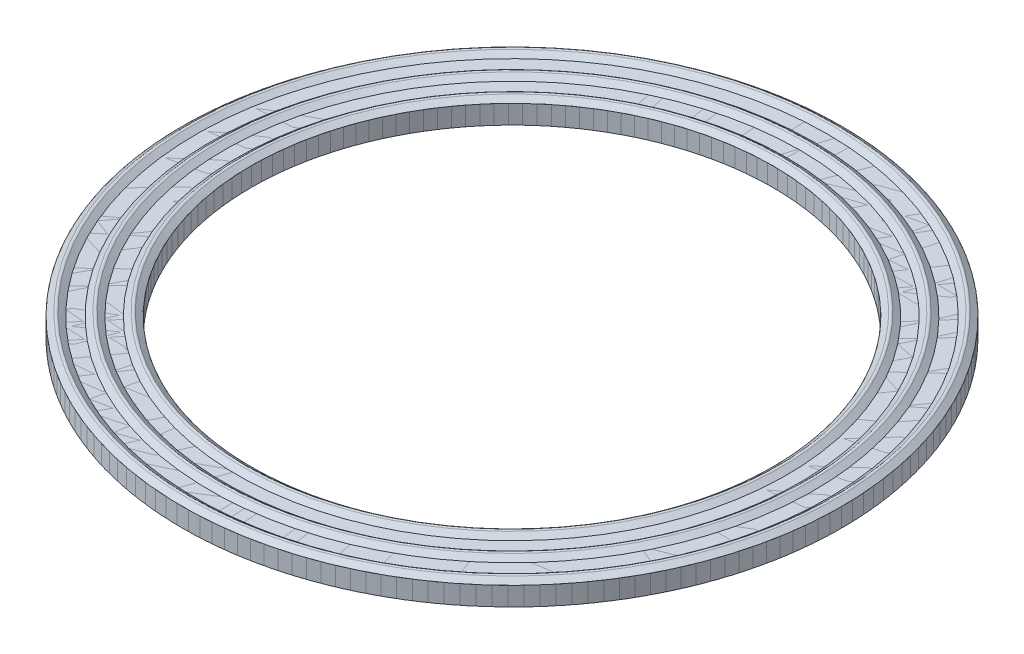
ISO-10303-21;
HEADER;
FILE_DESCRIPTION(('STEP AP214'),'2;1');
FILE_NAME('part.step','',(''),(''),'','','');
FILE_SCHEMA(('AUTOMOTIVE_DESIGN { 1 0 10303 214 1 1 1 1 }'));
ENDSEC;
DATA;
#1=APPLICATION_CONTEXT('core data for automotive mechanical design processes');
#2=APPLICATION_PROTOCOL_DEFINITION('international standard','automotive_design',2000,#1);
#3=PRODUCT_CONTEXT('',#1,'mechanical');
#4=PRODUCT('Part','Part','',(#3));
#5=PRODUCT_RELATED_PRODUCT_CATEGORY('part','',(#4));
#6=PRODUCT_DEFINITION_FORMATION('','',#4);
#7=PRODUCT_DEFINITION_CONTEXT('part definition',#1,'design');
#8=PRODUCT_DEFINITION('design','',#6,#7);
#9=PRODUCT_DEFINITION_SHAPE('','',#8);
#10=(LENGTH_UNIT() NAMED_UNIT(*) SI_UNIT(.MILLI.,.METRE.));
#11=(NAMED_UNIT(*) PLANE_ANGLE_UNIT() SI_UNIT($,.RADIAN.));
#12=(NAMED_UNIT(*) SI_UNIT($,.STERADIAN.) SOLID_ANGLE_UNIT());
#13=UNCERTAINTY_MEASURE_WITH_UNIT(LENGTH_MEASURE(1.E-05),#10,'distance_accuracy_value','');
#14=(GEOMETRIC_REPRESENTATION_CONTEXT(3) GLOBAL_UNCERTAINTY_ASSIGNED_CONTEXT((#13)) GLOBAL_UNIT_ASSIGNED_CONTEXT((#10,
#11,#12)) REPRESENTATION_CONTEXT('',''));
#15=CARTESIAN_POINT('',(0.,0.,0.));
#16=DIRECTION('',(0.,0.,1.));
#17=DIRECTION('',(1.,0.,0.));
#18=AXIS2_PLACEMENT_3D('',#15,#16,#17);
#19=CARTESIAN_POINT('',(0.,1.9558,0.));
#20=DIRECTION('',(0.,-1.,0.));
#21=DIRECTION('',(0.,0.,-1.));
#22=AXIS2_PLACEMENT_3D('',#19,#20,#21);
#23=CONICAL_SURFACE('',#22,34.32175,0.920002565653075);
#24=CARTESIAN_POINT('',(0.,2.39234857258727,0.));
#25=DIRECTION('',(0.,-1.,0.));
#26=DIRECTION('',(0.,0.,-1.));
#27=AXIS2_PLACEMENT_3D('',#24,#25,#26);
#28=CIRCLE('',#27,33.7484435549122);
#29=CARTESIAN_POINT('',(0.,2.39234857258727,-33.7484435549122));
#30=VERTEX_POINT('',#29);
#31=EDGE_CURVE('E11',#30,#30,#28,.T.);
#32=ORIENTED_EDGE('',*,*,#31,.T.);
#33=EDGE_LOOP('',(#32));
#34=FACE_BOUND('',#33,.T.);
#35=CARTESIAN_POINT('',(0.,1.9558,0.));
#36=DIRECTION('',(0.,-1.,0.));
#37=DIRECTION('',(0.,0.,-1.));
#38=AXIS2_PLACEMENT_3D('',#35,#36,#37);
#39=CIRCLE('',#38,34.32175);
#40=CARTESIAN_POINT('',(0.,1.9558,-34.32175));
#41=VERTEX_POINT('',#40);
#42=EDGE_CURVE('E110',#41,#41,#39,.T.);
#43=ORIENTED_EDGE('',*,*,#42,.F.);
#44=EDGE_LOOP('',(#43));
#45=FACE_BOUND('',#44,.T.);
#46=ADVANCED_FACE('F40',(#34,#45),#23,.T.);
#47=CARTESIAN_POINT('',(0.,2.19026536630032,0.));
#48=DIRECTION('',(0.,-1.,0.));
#49=DIRECTION('',(0.,0.,-1.));
#50=AXIS2_PLACEMENT_3D('',#47,#48,#49);
#51=TOROIDAL_SURFACE('',#50,33.5945657535996,0.254);
#52=CARTESIAN_POINT('',(0.,2.39234857258727,0.));
#53=DIRECTION('',(0.,-1.,0.));
#54=DIRECTION('',(0.,0.,-1.));
#55=AXIS2_PLACEMENT_3D('',#52,#53,#54);
#56=CIRCLE('',#55,33.4406879522871);
#57=CARTESIAN_POINT('',(0.,2.39234857258727,-33.4406879522871));
#58=VERTEX_POINT('',#57);
#59=EDGE_CURVE('E46',#58,#58,#56,.T.);
#60=ORIENTED_EDGE('',*,*,#59,.T.);
#61=EDGE_LOOP('',(#60));
#62=FACE_BOUND('',#61,.T.);
#63=ORIENTED_EDGE('',*,*,#31,.F.);
#64=EDGE_LOOP('',(#63));
#65=FACE_BOUND('',#64,.T.);
#66=ADVANCED_FACE('F118',(#62,#65),#51,.T.);
#67=CARTESIAN_POINT('',(0.,2.39234857258727,0.));
#68=DIRECTION('',(0.,1.,0.));
#69=DIRECTION('',(0.,0.,1.));
#70=AXIS2_PLACEMENT_3D('',#67,#68,#69);
#71=CONICAL_SURFACE('',#70,33.4406879522871,0.920002565653075);
#72=CARTESIAN_POINT('',(0.,1.9558,0.));
#73=DIRECTION('',(0.,-1.,0.));
#74=DIRECTION('',(0.,0.,-1.));
#75=AXIS2_PLACEMENT_3D('',#72,#73,#74);
#76=CIRCLE('',#75,32.8673815071992);
#77=CARTESIAN_POINT('',(0.,1.9558,-32.8673815071992));
#78=VERTEX_POINT('',#77);
#79=EDGE_CURVE('E50',#78,#78,#76,.T.);
#80=ORIENTED_EDGE('',*,*,#79,.T.);
#81=EDGE_LOOP('',(#80));
#82=FACE_BOUND('',#81,.T.);
#83=ORIENTED_EDGE('',*,*,#59,.F.);
#84=EDGE_LOOP('',(#83));
#85=FACE_BOUND('',#84,.T.);
#86=ADVANCED_FACE('F122',(#82,#85),#71,.F.);
#87=CARTESIAN_POINT('',(0.,1.9558,-31.4406180828677));
#88=DIRECTION('',(0.,1.,0.));
#89=DIRECTION('',(0.,0.,1.));
#90=AXIS2_PLACEMENT_3D('',#87,#88,#89);
#91=PLANE('',#90);
#92=CARTESIAN_POINT('',(0.,1.9558,0.));
#93=DIRECTION('',(0.,-1.,0.));
#94=DIRECTION('',(0.,0.,-1.));
#95=AXIS2_PLACEMENT_3D('',#92,#93,#94);
#96=CIRCLE('',#95,31.4406180828677);
#97=CARTESIAN_POINT('',(0.,1.9558,-31.4406180828677));
#98=VERTEX_POINT('',#97);
#99=EDGE_CURVE('E54',#98,#98,#96,.T.);
#100=ORIENTED_EDGE('',*,*,#99,.T.);
#101=EDGE_LOOP('',(#100));
#102=FACE_BOUND('',#101,.T.);
#103=ORIENTED_EDGE('',*,*,#79,.F.);
#104=EDGE_LOOP('',(#103));
#105=FACE_BOUND('',#104,.T.);
#106=ADVANCED_FACE('F126',(#102,#105),#91,.T.);
#107=CARTESIAN_POINT('',(0.,1.9558,0.));
#108=DIRECTION('',(0.,-1.,0.));
#109=DIRECTION('',(0.,0.,-1.));
#110=AXIS2_PLACEMENT_3D('',#107,#108,#109);
#111=CONICAL_SURFACE('',#110,31.4406180828677,0.920002565653078);
#112=CARTESIAN_POINT('',(0.,2.39234857258727,0.));
#113=DIRECTION('',(0.,-1.,0.));
#114=DIRECTION('',(0.,0.,-1.));
#115=AXIS2_PLACEMENT_3D('',#112,#113,#114);
#116=CIRCLE('',#115,30.8673116377798);
#117=CARTESIAN_POINT('',(0.,2.39234857258727,-30.8673116377798));
#118=VERTEX_POINT('',#117);
#119=EDGE_CURVE('E59',#118,#118,#116,.T.);
#120=ORIENTED_EDGE('',*,*,#119,.T.);
#121=EDGE_LOOP('',(#120));
#122=FACE_BOUND('',#121,.T.);
#123=ORIENTED_EDGE('',*,*,#99,.F.);
#124=EDGE_LOOP('',(#123));
#125=FACE_BOUND('',#124,.T.);
#126=ADVANCED_FACE('F133',(#122,#125),#111,.T.);
#127=CARTESIAN_POINT('',(0.,2.19026536630032,0.));
#128=DIRECTION('',(0.,-1.,0.));
#129=DIRECTION('',(0.,0.,-1.));
#130=AXIS2_PLACEMENT_3D('',#127,#128,#129);
#131=TOROIDAL_SURFACE('',#130,30.7134338364673,0.254);
#132=CARTESIAN_POINT('',(0.,2.39234857258727,0.));
#133=DIRECTION('',(0.,-1.,0.));
#134=DIRECTION('',(0.,0.,-1.));
#135=AXIS2_PLACEMENT_3D('',#132,#133,#134);
#136=CIRCLE('',#135,30.5595560351547);
#137=CARTESIAN_POINT('',(0.,2.39234857258727,-30.5595560351547));
#138=VERTEX_POINT('',#137);
#139=EDGE_CURVE('E62',#138,#138,#136,.T.);
#140=ORIENTED_EDGE('',*,*,#139,.T.);
#141=EDGE_LOOP('',(#140));
#142=FACE_BOUND('',#141,.T.);
#143=ORIENTED_EDGE('',*,*,#119,.F.);
#144=EDGE_LOOP('',(#143));
#145=FACE_BOUND('',#144,.T.);
#146=ADVANCED_FACE('F137',(#142,#145),#131,.T.);
#147=CARTESIAN_POINT('',(0.,2.39234857258727,0.));
#148=DIRECTION('',(0.,1.,0.));
#149=DIRECTION('',(0.,0.,1.));
#150=AXIS2_PLACEMENT_3D('',#147,#148,#149);
#151=CONICAL_SURFACE('',#150,30.5595560351547,0.920002565653072);
#152=CARTESIAN_POINT('',(0.,1.9558,0.));
#153=DIRECTION('',(0.,-1.,0.));
#154=DIRECTION('',(0.,0.,-1.));
#155=AXIS2_PLACEMENT_3D('',#152,#153,#154);
#156=CIRCLE('',#155,29.9862495900669);
#157=CARTESIAN_POINT('',(0.,1.9558,-29.9862495900669));
#158=VERTEX_POINT('',#157);
#159=EDGE_CURVE('E65',#158,#158,#156,.T.);
#160=ORIENTED_EDGE('',*,*,#159,.T.);
#161=EDGE_LOOP('',(#160));
#162=FACE_BOUND('',#161,.T.);
#163=ORIENTED_EDGE('',*,*,#139,.F.);
#164=EDGE_LOOP('',(#163));
#165=FACE_BOUND('',#164,.T.);
#166=ADVANCED_FACE('F141',(#162,#165),#151,.F.);
#167=CARTESIAN_POINT('',(0.,1.9558,-28.6260184928008));
#168=DIRECTION('',(0.,1.,0.));
#169=DIRECTION('',(0.,0.,1.));
#170=AXIS2_PLACEMENT_3D('',#167,#168,#169);
#171=PLANE('',#170);
#172=CARTESIAN_POINT('',(0.,1.9558,0.));
#173=DIRECTION('',(0.,-1.,0.));
#174=DIRECTION('',(0.,0.,-1.));
#175=AXIS2_PLACEMENT_3D('',#172,#173,#174);
#176=CIRCLE('',#175,28.6260184928008);
#177=CARTESIAN_POINT('',(0.,1.9558,-28.6260184928008));
#178=VERTEX_POINT('',#177);
#179=EDGE_CURVE('E68',#178,#178,#176,.T.);
#180=ORIENTED_EDGE('',*,*,#179,.T.);
#181=EDGE_LOOP('',(#180));
#182=FACE_BOUND('',#181,.T.);
#183=ORIENTED_EDGE('',*,*,#159,.F.);
#184=EDGE_LOOP('',(#183));
#185=FACE_BOUND('',#184,.T.);
#186=ADVANCED_FACE('F145',(#182,#185),#171,.T.);
#187=CARTESIAN_POINT('',(0.,1.9558,0.));
#188=DIRECTION('',(0.,-1.,0.));
#189=DIRECTION('',(0.,0.,-1.));
#190=AXIS2_PLACEMENT_3D('',#187,#188,#189);
#191=CONICAL_SURFACE('',#190,28.6260184928008,0.920002565653078);
#192=CARTESIAN_POINT('',(0.,2.39234857258727,0.));
#193=DIRECTION('',(0.,-1.,0.));
#194=DIRECTION('',(0.,0.,-1.));
#195=AXIS2_PLACEMENT_3D('',#192,#193,#194);
#196=CIRCLE('',#195,28.0527120477129);
#197=CARTESIAN_POINT('',(0.,2.39234857258727,-28.0527120477129));
#198=VERTEX_POINT('',#197);
#199=EDGE_CURVE('E71',#198,#198,#196,.T.);
#200=ORIENTED_EDGE('',*,*,#199,.T.);
#201=EDGE_LOOP('',(#200));
#202=FACE_BOUND('',#201,.T.);
#203=ORIENTED_EDGE('',*,*,#179,.F.);
#204=EDGE_LOOP('',(#203));
#205=FACE_BOUND('',#204,.T.);
#206=ADVANCED_FACE('F149',(#202,#205),#191,.T.);
#207=CARTESIAN_POINT('',(0.,2.19026536630032,0.));
#208=DIRECTION('',(0.,-1.,0.));
#209=DIRECTION('',(0.,0.,-1.));
#210=AXIS2_PLACEMENT_3D('',#207,#208,#209);
#211=TOROIDAL_SURFACE('',#210,27.8988342464004,0.254);
#212=CARTESIAN_POINT('',(0.,2.39234857258727,0.));
#213=DIRECTION('',(0.,-1.,0.));
#214=DIRECTION('',(0.,0.,-1.));
#215=AXIS2_PLACEMENT_3D('',#212,#213,#214);
#216=CIRCLE('',#215,27.7449564450878);
#217=CARTESIAN_POINT('',(0.,2.39234857258727,-27.7449564450878));
#218=VERTEX_POINT('',#217);
#219=EDGE_CURVE('E74',#218,#218,#216,.T.);
#220=ORIENTED_EDGE('',*,*,#219,.T.);
#221=EDGE_LOOP('',(#220));
#222=FACE_BOUND('',#221,.T.);
#223=ORIENTED_EDGE('',*,*,#199,.F.);
#224=EDGE_LOOP('',(#223));
#225=FACE_BOUND('',#224,.T.);
#226=ADVANCED_FACE('F153',(#222,#225),#211,.T.);
#227=CARTESIAN_POINT('',(0.,2.39234857258727,0.));
#228=DIRECTION('',(0.,1.,0.));
#229=DIRECTION('',(0.,0.,1.));
#230=AXIS2_PLACEMENT_3D('',#227,#228,#229);
#231=CONICAL_SURFACE('',#230,27.7449564450878,0.920002565653072);
#232=CARTESIAN_POINT('',(0.,1.9558,0.));
#233=DIRECTION('',(0.,-1.,0.));
#234=DIRECTION('',(0.,0.,-1.));
#235=AXIS2_PLACEMENT_3D('',#232,#233,#234);
#236=CIRCLE('',#235,27.17165);
#237=CARTESIAN_POINT('',(0.,1.9558,-27.17165));
#238=VERTEX_POINT('',#237);
#239=EDGE_CURVE('E77',#238,#238,#236,.T.);
#240=ORIENTED_EDGE('',*,*,#239,.T.);
#241=EDGE_LOOP('',(#240));
#242=FACE_BOUND('',#241,.T.);
#243=ORIENTED_EDGE('',*,*,#219,.F.);
#244=EDGE_LOOP('',(#243));
#245=FACE_BOUND('',#244,.T.);
#246=ADVANCED_FACE('F157',(#242,#245),#231,.F.);
#247=CARTESIAN_POINT('',(0.,0.,0.));
#248=DIRECTION('',(0.,-1.,0.));
#249=DIRECTION('',(0.,0.,-1.));
#250=AXIS2_PLACEMENT_3D('',#247,#248,#249);
#251=CYLINDRICAL_SURFACE('',#250,27.17165);
#252=CARTESIAN_POINT('',(0.,0.,0.));
#253=DIRECTION('',(0.,-1.,0.));
#254=DIRECTION('',(0.,0.,-1.));
#255=AXIS2_PLACEMENT_3D('',#252,#253,#254);
#256=CIRCLE('',#255,27.17165);
#257=CARTESIAN_POINT('',(0.,0.,-27.17165));
#258=VERTEX_POINT('',#257);
#259=EDGE_CURVE('E80',#258,#258,#256,.T.);
#260=ORIENTED_EDGE('',*,*,#259,.T.);
#261=EDGE_LOOP('',(#260));
#262=FACE_BOUND('',#261,.T.);
#263=ORIENTED_EDGE('',*,*,#239,.F.);
#264=EDGE_LOOP('',(#263));
#265=FACE_BOUND('',#264,.T.);
#266=ADVANCED_FACE('F161',(#262,#265),#251,.F.);
#267=CARTESIAN_POINT('',(0.,0.,-27.17165));
#268=DIRECTION('',(0.,-1.,0.));
#269=DIRECTION('',(0.,0.,-1.));
#270=AXIS2_PLACEMENT_3D('',#267,#268,#269);
#271=PLANE('',#270);
#272=CARTESIAN_POINT('',(0.,0.,0.));
#273=DIRECTION('',(0.,-1.,0.));
#274=DIRECTION('',(0.,0.,-1.));
#275=AXIS2_PLACEMENT_3D('',#272,#273,#274);
#276=CIRCLE('',#275,28.4780524521522);
#277=CARTESIAN_POINT('',(0.,0.,-28.4780524521522));
#278=VERTEX_POINT('',#277);
#279=EDGE_CURVE('E83',#278,#278,#276,.T.);
#280=ORIENTED_EDGE('',*,*,#279,.T.);
#281=EDGE_LOOP('',(#280));
#282=FACE_BOUND('',#281,.T.);
#283=ORIENTED_EDGE('',*,*,#259,.F.);
#284=EDGE_LOOP('',(#283));
#285=FACE_BOUND('',#284,.T.);
#286=ADVANCED_FACE('F165',(#282,#285),#271,.T.);
#287=CARTESIAN_POINT('',(0.,0.,0.));
#288=DIRECTION('',(0.,-1.,0.));
#289=DIRECTION('',(0.,0.,-1.));
#290=AXIS2_PLACEMENT_3D('',#287,#288,#289);
#291=CONICAL_SURFACE('',#290,28.4780524521522,1.10395800146213);
#292=CARTESIAN_POINT('',(0.,-0.324314024083534,0.));
#293=DIRECTION('',(0.,-1.,0.));
#294=DIRECTION('',(0.,0.,-1.));
#295=AXIS2_PLACEMENT_3D('',#292,#293,#294);
#296=CIRCLE('',#295,29.1215393206973);
#297=CARTESIAN_POINT('',(0.,-0.324314024083534,-29.1215393206973));
#298=VERTEX_POINT('',#297);
#299=EDGE_CURVE('E86',#298,#298,#296,.T.);
#300=ORIENTED_EDGE('',*,*,#299,.T.);
#301=EDGE_LOOP('',(#300));
#302=FACE_BOUND('',#301,.T.);
#303=ORIENTED_EDGE('',*,*,#279,.F.);
#304=EDGE_LOOP('',(#303));
#305=FACE_BOUND('',#304,.T.);
#306=ADVANCED_FACE('F169',(#302,#305),#291,.F.);
#307=CARTESIAN_POINT('',(0.,-0.0974931140565668,0.));
#308=DIRECTION('',(0.,-1.,0.));
#309=DIRECTION('',(0.,0.,-1.));
#310=AXIS2_PLACEMENT_3D('',#307,#308,#309);
#311=TOROIDAL_SURFACE('',#310,29.2358558758174,0.254000000000004);
#312=CARTESIAN_POINT('',(0.,-0.32431402408354,0.));
#313=DIRECTION('',(0.,-1.,0.));
#314=DIRECTION('',(0.,0.,-1.));
#315=AXIS2_PLACEMENT_3D('',#312,#313,#314);
#316=CIRCLE('',#315,29.3501724309376);
#317=CARTESIAN_POINT('',(0.,-0.32431402408354,-29.3501724309376));
#318=VERTEX_POINT('',#317);
#319=EDGE_CURVE('E89',#318,#318,#316,.T.);
#320=ORIENTED_EDGE('',*,*,#319,.T.);
#321=EDGE_LOOP('',(#320));
#322=FACE_BOUND('',#321,.T.);
#323=ORIENTED_EDGE('',*,*,#299,.F.);
#324=EDGE_LOOP('',(#323));
#325=FACE_BOUND('',#324,.T.);
#326=ADVANCED_FACE('F173',(#322,#325),#311,.T.);
#327=CARTESIAN_POINT('',(0.,-0.32431402408354,0.));
#328=DIRECTION('',(0.,1.,0.));
#329=DIRECTION('',(0.,0.,1.));
#330=AXIS2_PLACEMENT_3D('',#327,#328,#329);
#331=CONICAL_SURFACE('',#330,29.3501724309376,1.10395800146213);
#332=CARTESIAN_POINT('',(0.,0.,0.));
#333=DIRECTION('',(0.,-1.,0.));
#334=DIRECTION('',(0.,0.,-1.));
#335=AXIS2_PLACEMENT_3D('',#332,#333,#334);
#336=CIRCLE('',#335,29.9936592994827);
#337=CARTESIAN_POINT('',(0.,0.,-29.9936592994827));
#338=VERTEX_POINT('',#337);
#339=EDGE_CURVE('E92',#338,#338,#336,.T.);
#340=ORIENTED_EDGE('',*,*,#339,.T.);
#341=EDGE_LOOP('',(#340));
#342=FACE_BOUND('',#341,.T.);
#343=ORIENTED_EDGE('',*,*,#319,.F.);
#344=EDGE_LOOP('',(#343));
#345=FACE_BOUND('',#344,.T.);
#346=ADVANCED_FACE('F177',(#342,#345),#331,.T.);
#347=CARTESIAN_POINT('',(0.,0.,-29.9936592994827));
#348=DIRECTION('',(0.,-1.,0.));
#349=DIRECTION('',(0.,0.,-1.));
#350=AXIS2_PLACEMENT_3D('',#347,#348,#349);
#351=PLANE('',#350);
#352=CARTESIAN_POINT('',(0.,0.,0.));
#353=DIRECTION('',(0.,-1.,0.));
#354=DIRECTION('',(0.,0.,-1.));
#355=AXIS2_PLACEMENT_3D('',#352,#353,#354);
#356=CIRCLE('',#355,31.4535032340382);
#357=CARTESIAN_POINT('',(0.,0.,-31.4535032340382));
#358=VERTEX_POINT('',#357);
#359=EDGE_CURVE('E95',#358,#358,#356,.T.);
#360=ORIENTED_EDGE('',*,*,#359,.T.);
#361=EDGE_LOOP('',(#360));
#362=FACE_BOUND('',#361,.T.);
#363=ORIENTED_EDGE('',*,*,#339,.F.);
#364=EDGE_LOOP('',(#363));
#365=FACE_BOUND('',#364,.T.);
#366=ADVANCED_FACE('F181',(#362,#365),#351,.T.);
#367=CARTESIAN_POINT('',(0.,0.,0.));
#368=DIRECTION('',(0.,-1.,0.));
#369=DIRECTION('',(0.,0.,-1.));
#370=AXIS2_PLACEMENT_3D('',#367,#368,#369);
#371=CONICAL_SURFACE('',#370,31.4535032340382,1.04791945360359);
#372=CARTESIAN_POINT('',(0.,-0.35984613189908,0.));
#373=DIRECTION('',(0.,-1.,0.));
#374=DIRECTION('',(0.,0.,-1.));
#375=AXIS2_PLACEMENT_3D('',#372,#373,#374);
#376=CIRCLE('',#375,32.0778154136122);
#377=CARTESIAN_POINT('',(0.,-0.35984613189908,-32.0778154136122));
#378=VERTEX_POINT('',#377);
#379=EDGE_CURVE('E98',#378,#378,#376,.T.);
#380=ORIENTED_EDGE('',*,*,#379,.T.);
#381=EDGE_LOOP('',(#380));
#382=FACE_BOUND('',#381,.T.);
#383=ORIENTED_EDGE('',*,*,#359,.F.);
#384=EDGE_LOOP('',(#383));
#385=FACE_BOUND('',#384,.T.);
#386=ADVANCED_FACE('F185',(#382,#385),#371,.F.);
#387=CARTESIAN_POINT('',(0.,-0.13978405505815,0.));
#388=DIRECTION('',(0.,-1.,0.));
#389=DIRECTION('',(0.,0.,-1.));
#390=AXIS2_PLACEMENT_3D('',#387,#388,#389);
#391=TOROIDAL_SURFACE('',#390,32.2046565833343,0.253999999999996);
#392=CARTESIAN_POINT('',(0.,-0.359846131899082,0.));
#393=DIRECTION('',(0.,-1.,0.));
#394=DIRECTION('',(0.,0.,-1.));
#395=AXIS2_PLACEMENT_3D('',#392,#393,#394);
#396=CIRCLE('',#395,32.3314977530563);
#397=CARTESIAN_POINT('',(0.,-0.359846131899082,-32.3314977530563));
#398=VERTEX_POINT('',#397);
#399=EDGE_CURVE('E101',#398,#398,#396,.T.);
#400=ORIENTED_EDGE('',*,*,#399,.T.);
#401=EDGE_LOOP('',(#400));
#402=FACE_BOUND('',#401,.T.);
#403=ORIENTED_EDGE('',*,*,#379,.F.);
#404=EDGE_LOOP('',(#403));
#405=FACE_BOUND('',#404,.T.);
#406=ADVANCED_FACE('F189',(#402,#405),#391,.T.);
#407=CARTESIAN_POINT('',(0.,-0.359846131899082,0.));
#408=DIRECTION('',(0.,1.,0.));
#409=DIRECTION('',(0.,0.,1.));
#410=AXIS2_PLACEMENT_3D('',#407,#408,#409);
#411=CONICAL_SURFACE('',#410,32.3314977530563,1.04791945360359);
#412=CARTESIAN_POINT('',(0.,0.,0.));
#413=DIRECTION('',(0.,-1.,0.));
#414=DIRECTION('',(0.,0.,-1.));
#415=AXIS2_PLACEMENT_3D('',#412,#413,#414);
#416=CIRCLE('',#415,32.9558099326304);
#417=CARTESIAN_POINT('',(0.,0.,-32.9558099326304));
#418=VERTEX_POINT('',#417);
#419=EDGE_CURVE('E104',#418,#418,#416,.T.);
#420=ORIENTED_EDGE('',*,*,#419,.T.);
#421=EDGE_LOOP('',(#420));
#422=FACE_BOUND('',#421,.T.);
#423=ORIENTED_EDGE('',*,*,#399,.F.);
#424=EDGE_LOOP('',(#423));
#425=FACE_BOUND('',#424,.T.);
#426=ADVANCED_FACE('F193',(#422,#425),#411,.T.);
#427=CARTESIAN_POINT('',(0.,0.,-34.32175));
#428=DIRECTION('',(0.,-1.,0.));
#429=DIRECTION('',(0.,0.,-1.));
#430=AXIS2_PLACEMENT_3D('',#427,#428,#429);
#431=PLANE('',#430);
#432=CARTESIAN_POINT('',(0.,0.,0.));
#433=DIRECTION('',(0.,-1.,0.));
#434=DIRECTION('',(0.,0.,-1.));
#435=AXIS2_PLACEMENT_3D('',#432,#433,#434);
#436=CIRCLE('',#435,34.32175);
#437=CARTESIAN_POINT('',(0.,0.,-34.32175));
#438=VERTEX_POINT('',#437);
#439=EDGE_CURVE('E107',#438,#438,#436,.T.);
#440=ORIENTED_EDGE('',*,*,#439,.T.);
#441=EDGE_LOOP('',(#440));
#442=FACE_BOUND('',#441,.T.);
#443=ORIENTED_EDGE('',*,*,#419,.F.);
#444=EDGE_LOOP('',(#443));
#445=FACE_BOUND('',#444,.T.);
#446=ADVANCED_FACE('F197',(#442,#445),#431,.T.);
#447=CARTESIAN_POINT('',(0.,0.,0.));
#448=DIRECTION('',(0.,-1.,0.));
#449=DIRECTION('',(0.,0.,-1.));
#450=AXIS2_PLACEMENT_3D('',#447,#448,#449);
#451=CYLINDRICAL_SURFACE('',#450,34.32175);
#452=ORIENTED_EDGE('',*,*,#42,.T.);
#453=EDGE_LOOP('',(#452));
#454=FACE_BOUND('',#453,.T.);
#455=ORIENTED_EDGE('',*,*,#439,.F.);
#456=EDGE_LOOP('',(#455));
#457=FACE_BOUND('',#456,.T.);
#458=ADVANCED_FACE('F114',(#454,#457),#451,.T.);
#459=CLOSED_SHELL('',(#46,#66,#86,#106,#126,#146,#166,#186,#206,#226,#246,#266,#286,#306,#326,
#346,#366,#386,#406,#426,#446,#458));
#460=MANIFOLD_SOLID_BREP('B2',#459);
#461=CARTESIAN_POINT('',(0.,1.9558,0.));
#462=DIRECTION('',(0.,1.,0.));
#463=DIRECTION('',(0.,0.,1.));
#464=AXIS2_PLACEMENT_3D('',#461,#462,#463);
#465=PLANE('',#464);
#466=CARTESIAN_POINT('',(0.,1.9558,0.));
#467=DIRECTION('',(0.,1.,0.));
#468=DIRECTION('',(0.,0.,1.));
#469=AXIS2_PLACEMENT_3D('',#466,#467,#468);
#470=CIRCLE('',#469,34.32175);
#471=CARTESIAN_POINT('',(0.,1.9558,34.32175));
#472=VERTEX_POINT('',#471);
#473=EDGE_CURVE('E39',#472,#472,#470,.T.);
#474=ORIENTED_EDGE('',*,*,#473,.T.);
#475=EDGE_LOOP('',(#474));
#476=FACE_BOUND('',#475,.T.);
#477=CARTESIAN_POINT('',(0.,1.9558,0.));
#478=DIRECTION('',(0.,1.,0.));
#479=DIRECTION('',(0.,0.,1.));
#480=AXIS2_PLACEMENT_3D('',#477,#478,#479);
#481=CIRCLE('',#480,27.17165);
#482=CARTESIAN_POINT('',(0.,1.9558,27.17165));
#483=VERTEX_POINT('',#482);
#484=EDGE_CURVE('E382',#483,#483,#481,.T.);
#485=ORIENTED_EDGE('',*,*,#484,.F.);
#486=EDGE_LOOP('',(#485));
#487=FACE_BOUND('',#486,.T.);
#488=ADVANCED_FACE('F371',(#476,#487),#465,.T.);
#489=CARTESIAN_POINT('',(0.,0.,0.));
#490=DIRECTION('',(0.,1.,0.));
#491=DIRECTION('',(0.,0.,1.));
#492=AXIS2_PLACEMENT_3D('',#489,#490,#491);
#493=PLANE('',#492);
#494=CARTESIAN_POINT('',(0.,0.,0.));
#495=DIRECTION('',(0.,1.,0.));
#496=DIRECTION('',(0.,0.,1.));
#497=AXIS2_PLACEMENT_3D('',#494,#495,#496);
#498=CIRCLE('',#497,34.32175);
#499=CARTESIAN_POINT('',(0.,0.,34.32175));
#500=VERTEX_POINT('',#499);
#501=EDGE_CURVE('E375',#500,#500,#498,.T.);
#502=ORIENTED_EDGE('',*,*,#501,.F.);
#503=EDGE_LOOP('',(#502));
#504=FACE_BOUND('',#503,.T.);
#505=CARTESIAN_POINT('',(0.,0.,0.));
#506=DIRECTION('',(0.,1.,0.));
#507=DIRECTION('',(0.,0.,1.));
#508=AXIS2_PLACEMENT_3D('',#505,#506,#507);
#509=CIRCLE('',#508,27.17165);
#510=CARTESIAN_POINT('',(0.,0.,27.17165));
#511=VERTEX_POINT('',#510);
#512=EDGE_CURVE('E384',#511,#511,#509,.T.);
#513=ORIENTED_EDGE('',*,*,#512,.T.);
#514=EDGE_LOOP('',(#513));
#515=FACE_BOUND('',#514,.T.);
#516=ADVANCED_FACE('F394',(#504,#515),#493,.F.);
#517=CARTESIAN_POINT('',(0.,1.9558,0.));
#518=DIRECTION('',(0.,-1.,0.));
#519=DIRECTION('',(0.,0.,-1.));
#520=AXIS2_PLACEMENT_3D('',#517,#518,#519);
#521=CYLINDRICAL_SURFACE('',#520,34.32175);
#522=ORIENTED_EDGE('',*,*,#473,.F.);
#523=EDGE_LOOP('',(#522));
#524=FACE_BOUND('',#523,.T.);
#525=ORIENTED_EDGE('',*,*,#501,.T.);
#526=EDGE_LOOP('',(#525));
#527=FACE_BOUND('',#526,.T.);
#528=ADVANCED_FACE('F373',(#524,#527),#521,.T.);
#529=CARTESIAN_POINT('',(0.,1.9558,0.));
#530=DIRECTION('',(0.,-1.,0.));
#531=DIRECTION('',(0.,0.,-1.));
#532=AXIS2_PLACEMENT_3D('',#529,#530,#531);
#533=CYLINDRICAL_SURFACE('',#532,27.17165);
#534=ORIENTED_EDGE('',*,*,#484,.T.);
#535=EDGE_LOOP('',(#534));
#536=FACE_BOUND('',#535,.T.);
#537=ORIENTED_EDGE('',*,*,#512,.F.);
#538=EDGE_LOOP('',(#537));
#539=FACE_BOUND('',#538,.T.);
#540=ADVANCED_FACE('F390',(#536,#539),#533,.F.);
#541=CLOSED_SHELL('',(#488,#516,#528,#540));
#542=MANIFOLD_SOLID_BREP('B6_NOT_SHOWN',#541);
#543=ADVANCED_BREP_SHAPE_REPRESENTATION('',(#18,#460,#542),#14);
#544=SHAPE_DEFINITION_REPRESENTATION(#9,#543);
ENDSEC;
END-ISO-10303-21;
